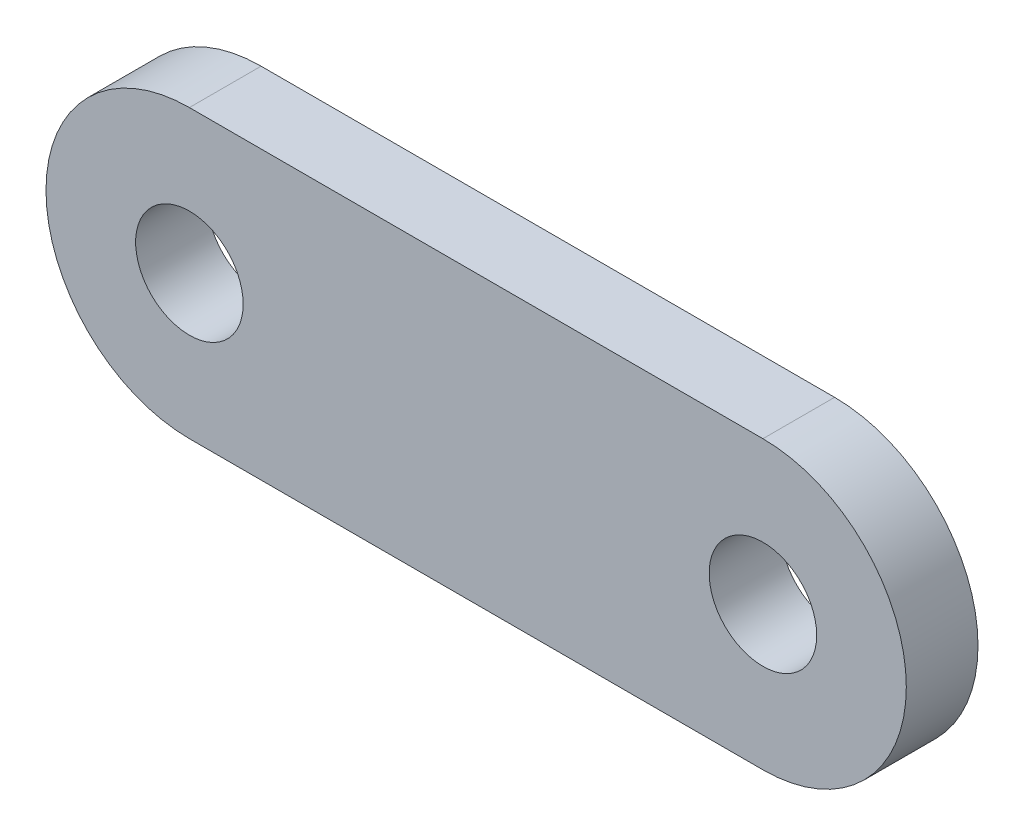
ISO-10303-21;
HEADER;
FILE_DESCRIPTION(('STEP AP214'),'2;1');
FILE_NAME('part.step','',(''),(''),'','','');
FILE_SCHEMA(('AUTOMOTIVE_DESIGN { 1 0 10303 214 1 1 1 1 }'));
ENDSEC;
DATA;
#1=APPLICATION_CONTEXT('core data for automotive mechanical design processes');
#2=APPLICATION_PROTOCOL_DEFINITION('international standard','automotive_design',2000,#1);
#3=PRODUCT_CONTEXT('',#1,'mechanical');
#4=PRODUCT('Part','Part','',(#3));
#5=PRODUCT_RELATED_PRODUCT_CATEGORY('part','',(#4));
#6=PRODUCT_DEFINITION_FORMATION('','',#4);
#7=PRODUCT_DEFINITION_CONTEXT('part definition',#1,'design');
#8=PRODUCT_DEFINITION('design','',#6,#7);
#9=PRODUCT_DEFINITION_SHAPE('','',#8);
#10=(LENGTH_UNIT() NAMED_UNIT(*) SI_UNIT(.MILLI.,.METRE.));
#11=(NAMED_UNIT(*) PLANE_ANGLE_UNIT() SI_UNIT($,.RADIAN.));
#12=(NAMED_UNIT(*) SI_UNIT($,.STERADIAN.) SOLID_ANGLE_UNIT());
#13=UNCERTAINTY_MEASURE_WITH_UNIT(LENGTH_MEASURE(1.E-05),#10,'distance_accuracy_value','');
#14=(GEOMETRIC_REPRESENTATION_CONTEXT(3) GLOBAL_UNCERTAINTY_ASSIGNED_CONTEXT((#13)) GLOBAL_UNIT_ASSIGNED_CONTEXT((#10,
#11,#12)) REPRESENTATION_CONTEXT('',''));
#15=CARTESIAN_POINT('',(0.,0.,0.));
#16=DIRECTION('',(0.,0.,1.));
#17=DIRECTION('',(1.,0.,0.));
#18=AXIS2_PLACEMENT_3D('',#15,#16,#17);
#19=CARTESIAN_POINT('',(-25.4,0.,6.35));
#20=DIRECTION('',(0.,0.,1.));
#21=DIRECTION('',(1.,0.,0.));
#22=AXIS2_PLACEMENT_3D('',#19,#20,#21);
#23=PLANE('',#22);
#24=CARTESIAN_POINT('',(25.4,0.,6.35));
#25=DIRECTION('',(0.,0.,1.));
#26=DIRECTION('',(1.,0.,0.));
#27=AXIS2_PLACEMENT_3D('',#24,#25,#26);
#28=CIRCLE('',#27,4.7625);
#29=CARTESIAN_POINT('',(30.1625,0.,6.35));
#30=VERTEX_POINT('',#29);
#31=EDGE_CURVE('E100',#30,#30,#28,.T.);
#32=ORIENTED_EDGE('',*,*,#31,.F.);
#33=EDGE_LOOP('',(#32));
#34=FACE_BOUND('',#33,.T.);
#35=CARTESIAN_POINT('',(-25.4,0.,6.35));
#36=DIRECTION('',(0.,0.,1.));
#37=DIRECTION('',(1.,0.,0.));
#38=AXIS2_PLACEMENT_3D('',#35,#36,#37);
#39=CIRCLE('',#38,12.7);
#40=CARTESIAN_POINT('',(-25.4,12.7,6.35));
#41=VERTEX_POINT('',#40);
#42=CARTESIAN_POINT('',(-25.4,-12.7,6.35));
#43=VERTEX_POINT('',#42);
#44=EDGE_CURVE('E85',#41,#43,#39,.T.);
#45=ORIENTED_EDGE('',*,*,#44,.T.);
#46=DIRECTION('',(1.,0.,0.));
#47=VECTOR('',#46,1.);
#48=CARTESIAN_POINT('',(-25.4,-12.7,6.35));
#49=LINE('',#48,#47);
#50=CARTESIAN_POINT('',(25.4,-12.7,6.35));
#51=VERTEX_POINT('',#50);
#52=EDGE_CURVE('E80',#43,#51,#49,.T.);
#53=ORIENTED_EDGE('',*,*,#52,.T.);
#54=CARTESIAN_POINT('',(25.4,0.,6.35));
#55=DIRECTION('',(0.,0.,1.));
#56=DIRECTION('',(1.,0.,0.));
#57=AXIS2_PLACEMENT_3D('',#54,#55,#56);
#58=CIRCLE('',#57,12.7);
#59=CARTESIAN_POINT('',(25.4,12.7,6.35));
#60=VERTEX_POINT('',#59);
#61=EDGE_CURVE('E83',#51,#60,#58,.T.);
#62=ORIENTED_EDGE('',*,*,#61,.T.);
#63=DIRECTION('',(-1.,0.,0.));
#64=VECTOR('',#63,1.);
#65=CARTESIAN_POINT('',(-25.4,12.7,6.35));
#66=LINE('',#65,#64);
#67=EDGE_CURVE('E50',#60,#41,#66,.T.);
#68=ORIENTED_EDGE('',*,*,#67,.T.);
#69=EDGE_LOOP('',(#45,#53,#62,#68));
#70=FACE_BOUND('',#69,.T.);
#71=CARTESIAN_POINT('',(-25.4,0.,6.35));
#72=DIRECTION('',(0.,0.,1.));
#73=DIRECTION('',(1.,0.,0.));
#74=AXIS2_PLACEMENT_3D('',#71,#72,#73);
#75=CIRCLE('',#74,4.7625);
#76=CARTESIAN_POINT('',(-20.6375,0.,6.35));
#77=VERTEX_POINT('',#76);
#78=EDGE_CURVE('E115',#77,#77,#75,.T.);
#79=ORIENTED_EDGE('',*,*,#78,.F.);
#80=EDGE_LOOP('',(#79));
#81=FACE_BOUND('',#80,.T.);
#82=ADVANCED_FACE('F33',(#34,#70,#81),#23,.T.);
#83=CARTESIAN_POINT('',(-25.4,0.,0.));
#84=DIRECTION('',(0.,0.,1.));
#85=DIRECTION('',(1.,0.,0.));
#86=AXIS2_PLACEMENT_3D('',#83,#84,#85);
#87=PLANE('',#86);
#88=CARTESIAN_POINT('',(-25.4,0.,0.));
#89=DIRECTION('',(0.,0.,1.));
#90=DIRECTION('',(1.,0.,0.));
#91=AXIS2_PLACEMENT_3D('',#88,#89,#90);
#92=CIRCLE('',#91,12.7);
#93=CARTESIAN_POINT('',(-25.4,12.7,0.));
#94=VERTEX_POINT('',#93);
#95=CARTESIAN_POINT('',(-25.4,-12.7,0.));
#96=VERTEX_POINT('',#95);
#97=EDGE_CURVE('E97',#94,#96,#92,.T.);
#98=ORIENTED_EDGE('',*,*,#97,.F.);
#99=DIRECTION('',(-1.,0.,0.));
#100=VECTOR('',#99,1.);
#101=CARTESIAN_POINT('',(-25.4,12.7,0.));
#102=LINE('',#101,#100);
#103=CARTESIAN_POINT('',(25.4,12.7,0.));
#104=VERTEX_POINT('',#103);
#105=EDGE_CURVE('E73',#104,#94,#102,.T.);
#106=ORIENTED_EDGE('',*,*,#105,.F.);
#107=CARTESIAN_POINT('',(25.4,0.,0.));
#108=DIRECTION('',(0.,0.,1.));
#109=DIRECTION('',(1.,0.,0.));
#110=AXIS2_PLACEMENT_3D('',#107,#108,#109);
#111=CIRCLE('',#110,12.7);
#112=CARTESIAN_POINT('',(25.4,-12.7,0.));
#113=VERTEX_POINT('',#112);
#114=EDGE_CURVE('E67',#113,#104,#111,.T.);
#115=ORIENTED_EDGE('',*,*,#114,.F.);
#116=DIRECTION('',(1.,0.,0.));
#117=VECTOR('',#116,1.);
#118=CARTESIAN_POINT('',(-25.4,-12.7,0.));
#119=LINE('',#118,#117);
#120=EDGE_CURVE('E89',#96,#113,#119,.T.);
#121=ORIENTED_EDGE('',*,*,#120,.F.);
#122=EDGE_LOOP('',(#98,#106,#115,#121));
#123=FACE_BOUND('',#122,.T.);
#124=CARTESIAN_POINT('',(25.4,0.,0.));
#125=DIRECTION('',(0.,0.,1.));
#126=DIRECTION('',(1.,0.,0.));
#127=AXIS2_PLACEMENT_3D('',#124,#125,#126);
#128=CIRCLE('',#127,4.7625);
#129=CARTESIAN_POINT('',(30.1625,0.,0.));
#130=VERTEX_POINT('',#129);
#131=EDGE_CURVE('E112',#130,#130,#128,.T.);
#132=ORIENTED_EDGE('',*,*,#131,.T.);
#133=EDGE_LOOP('',(#132));
#134=FACE_BOUND('',#133,.T.);
#135=CARTESIAN_POINT('',(-25.4,0.,0.));
#136=DIRECTION('',(0.,0.,1.));
#137=DIRECTION('',(1.,0.,0.));
#138=AXIS2_PLACEMENT_3D('',#135,#136,#137);
#139=CIRCLE('',#138,4.7625);
#140=CARTESIAN_POINT('',(-20.6375,0.,0.));
#141=VERTEX_POINT('',#140);
#142=EDGE_CURVE('E118',#141,#141,#139,.T.);
#143=ORIENTED_EDGE('',*,*,#142,.T.);
#144=EDGE_LOOP('',(#143));
#145=FACE_BOUND('',#144,.T.);
#146=ADVANCED_FACE('F108',(#123,#134,#145),#87,.F.);
#147=CARTESIAN_POINT('',(-25.4,0.,6.35));
#148=DIRECTION('',(0.,0.,-1.));
#149=DIRECTION('',(-1.,0.,0.));
#150=AXIS2_PLACEMENT_3D('',#147,#148,#149);
#151=CYLINDRICAL_SURFACE('',#150,12.7);
#152=ORIENTED_EDGE('',*,*,#97,.T.);
#153=DIRECTION('',(0.,0.,-1.));
#154=VECTOR('',#153,1.);
#155=CARTESIAN_POINT('',(-25.4,-12.7,6.35));
#156=LINE('',#155,#154);
#157=EDGE_CURVE('E11',#43,#96,#156,.T.);
#158=ORIENTED_EDGE('',*,*,#157,.F.);
#159=ORIENTED_EDGE('',*,*,#44,.F.);
#160=DIRECTION('',(0.,0.,-1.));
#161=VECTOR('',#160,1.);
#162=CARTESIAN_POINT('',(-25.4,12.7,6.35));
#163=LINE('',#162,#161);
#164=EDGE_CURVE('E93',#41,#94,#163,.T.);
#165=ORIENTED_EDGE('',*,*,#164,.T.);
#166=EDGE_LOOP('',(#152,#158,#159,#165));
#167=FACE_BOUND('',#166,.T.);
#168=ADVANCED_FACE('F35',(#167),#151,.T.);
#169=CARTESIAN_POINT('',(-25.4,-12.7,6.35));
#170=DIRECTION('',(0.,1.,0.));
#171=DIRECTION('',(-1.,0.,0.));
#172=AXIS2_PLACEMENT_3D('',#169,#170,#171);
#173=PLANE('',#172);
#174=ORIENTED_EDGE('',*,*,#120,.T.);
#175=DIRECTION('',(0.,0.,-1.));
#176=VECTOR('',#175,1.);
#177=CARTESIAN_POINT('',(25.4,-12.7,6.35));
#178=LINE('',#177,#176);
#179=EDGE_CURVE('E42',#51,#113,#178,.T.);
#180=ORIENTED_EDGE('',*,*,#179,.F.);
#181=ORIENTED_EDGE('',*,*,#52,.F.);
#182=ORIENTED_EDGE('',*,*,#157,.T.);
#183=EDGE_LOOP('',(#174,#180,#181,#182));
#184=FACE_BOUND('',#183,.T.);
#185=ADVANCED_FACE('F88',(#184),#173,.F.);
#186=CARTESIAN_POINT('',(25.4,0.,6.35));
#187=DIRECTION('',(0.,0.,-1.));
#188=DIRECTION('',(-1.,0.,0.));
#189=AXIS2_PLACEMENT_3D('',#186,#187,#188);
#190=CYLINDRICAL_SURFACE('',#189,12.7);
#191=ORIENTED_EDGE('',*,*,#114,.T.);
#192=DIRECTION('',(0.,0.,-1.));
#193=VECTOR('',#192,1.);
#194=CARTESIAN_POINT('',(25.4,12.7,6.35));
#195=LINE('',#194,#193);
#196=EDGE_CURVE('E90',#60,#104,#195,.T.);
#197=ORIENTED_EDGE('',*,*,#196,.F.);
#198=ORIENTED_EDGE('',*,*,#61,.F.);
#199=ORIENTED_EDGE('',*,*,#179,.T.);
#200=EDGE_LOOP('',(#191,#197,#198,#199));
#201=FACE_BOUND('',#200,.T.);
#202=ADVANCED_FACE('F91',(#201),#190,.T.);
#203=CARTESIAN_POINT('',(-25.4,12.7,6.35));
#204=DIRECTION('',(0.,-1.,0.));
#205=DIRECTION('',(1.,0.,0.));
#206=AXIS2_PLACEMENT_3D('',#203,#204,#205);
#207=PLANE('',#206);
#208=ORIENTED_EDGE('',*,*,#105,.T.);
#209=ORIENTED_EDGE('',*,*,#164,.F.);
#210=ORIENTED_EDGE('',*,*,#67,.F.);
#211=ORIENTED_EDGE('',*,*,#196,.T.);
#212=EDGE_LOOP('',(#208,#209,#210,#211));
#213=FACE_BOUND('',#212,.T.);
#214=ADVANCED_FACE('F105',(#213),#207,.F.);
#215=CARTESIAN_POINT('',(25.4,0.,6.35));
#216=DIRECTION('',(0.,0.,-1.));
#217=DIRECTION('',(-1.,0.,0.));
#218=AXIS2_PLACEMENT_3D('',#215,#216,#217);
#219=CYLINDRICAL_SURFACE('',#218,4.7625);
#220=ORIENTED_EDGE('',*,*,#31,.T.);
#221=EDGE_LOOP('',(#220));
#222=FACE_BOUND('',#221,.T.);
#223=ORIENTED_EDGE('',*,*,#131,.F.);
#224=EDGE_LOOP('',(#223));
#225=FACE_BOUND('',#224,.T.);
#226=ADVANCED_FACE('F135',(#222,#225),#219,.F.);
#227=CARTESIAN_POINT('',(-25.4,0.,6.35));
#228=DIRECTION('',(0.,0.,-1.));
#229=DIRECTION('',(-1.,0.,0.));
#230=AXIS2_PLACEMENT_3D('',#227,#228,#229);
#231=CYLINDRICAL_SURFACE('',#230,4.7625);
#232=ORIENTED_EDGE('',*,*,#78,.T.);
#233=EDGE_LOOP('',(#232));
#234=FACE_BOUND('',#233,.T.);
#235=ORIENTED_EDGE('',*,*,#142,.F.);
#236=EDGE_LOOP('',(#235));
#237=FACE_BOUND('',#236,.T.);
#238=ADVANCED_FACE('F124',(#234,#237),#231,.F.);
#239=CLOSED_SHELL('',(#82,#146,#168,#185,#202,#214,#226,#238));
#240=MANIFOLD_SOLID_BREP('B2',#239);
#241=ADVANCED_BREP_SHAPE_REPRESENTATION('',(#18,#240),#14);
#242=SHAPE_DEFINITION_REPRESENTATION(#9,#241);
ENDSEC;
END-ISO-10303-21;
